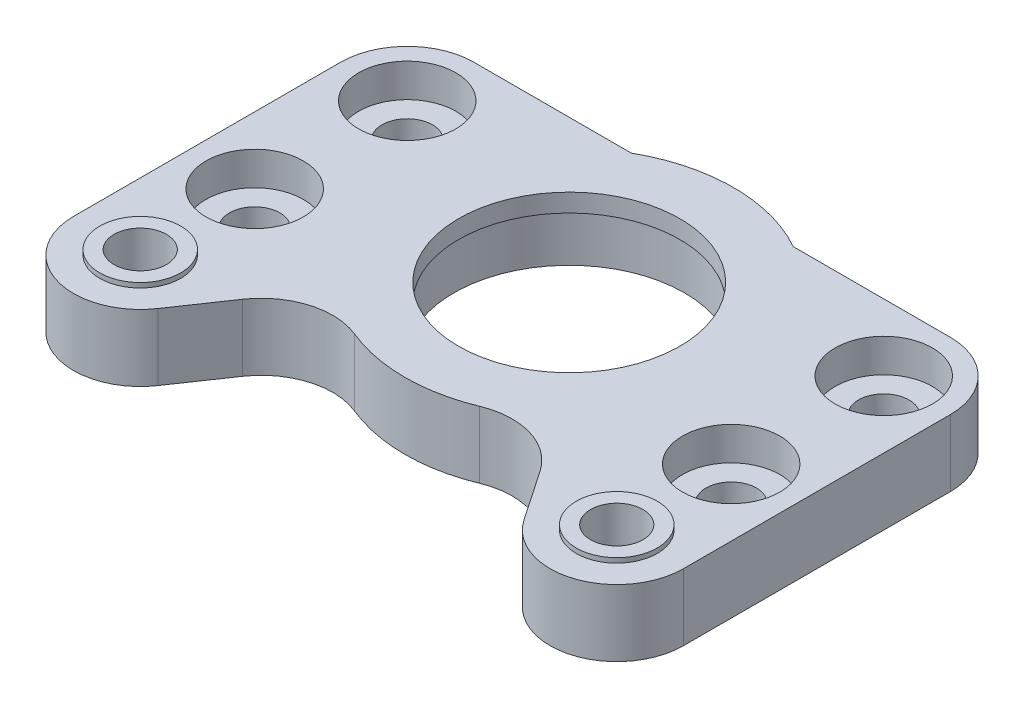
ISO-10303-21;
HEADER;
FILE_DESCRIPTION(('STEP AP214'),'2;1');
FILE_NAME('part.step','',(''),(''),'','','');
FILE_SCHEMA(('AUTOMOTIVE_DESIGN { 1 0 10303 214 1 1 1 1 }'));
ENDSEC;
DATA;
#1=APPLICATION_CONTEXT('core data for automotive mechanical design processes');
#2=APPLICATION_PROTOCOL_DEFINITION('international standard','automotive_design',2000,#1);
#3=PRODUCT_CONTEXT('',#1,'mechanical');
#4=PRODUCT('Part','Part','',(#3));
#5=PRODUCT_RELATED_PRODUCT_CATEGORY('part','',(#4));
#6=PRODUCT_DEFINITION_FORMATION('','',#4);
#7=PRODUCT_DEFINITION_CONTEXT('part definition',#1,'design');
#8=PRODUCT_DEFINITION('design','',#6,#7);
#9=PRODUCT_DEFINITION_SHAPE('','',#8);
#10=(LENGTH_UNIT() NAMED_UNIT(*) SI_UNIT(.MILLI.,.METRE.));
#11=(NAMED_UNIT(*) PLANE_ANGLE_UNIT() SI_UNIT($,.RADIAN.));
#12=(NAMED_UNIT(*) SI_UNIT($,.STERADIAN.) SOLID_ANGLE_UNIT());
#13=UNCERTAINTY_MEASURE_WITH_UNIT(LENGTH_MEASURE(1.E-05),#10,'distance_accuracy_value','');
#14=(GEOMETRIC_REPRESENTATION_CONTEXT(3) GLOBAL_UNCERTAINTY_ASSIGNED_CONTEXT((#13)) GLOBAL_UNIT_ASSIGNED_CONTEXT((#10,
#11,#12)) REPRESENTATION_CONTEXT('',''));
#15=CARTESIAN_POINT('',(0.,0.,0.));
#16=DIRECTION('',(0.,0.,1.));
#17=DIRECTION('',(1.,0.,0.));
#18=AXIS2_PLACEMENT_3D('',#15,#16,#17);
#19=CARTESIAN_POINT('',(0.,7.,0.));
#20=DIRECTION('',(0.,1.,0.));
#21=DIRECTION('',(0.,0.,1.));
#22=AXIS2_PLACEMENT_3D('',#19,#20,#21);
#23=PLANE('',#22);
#24=CARTESIAN_POINT('',(7.,7.,35.));
#25=DIRECTION('',(0.,1.,0.));
#26=DIRECTION('',(0.,0.,1.));
#27=AXIS2_PLACEMENT_3D('',#24,#25,#26);
#28=CIRCLE('',#27,4.25);
#29=CARTESIAN_POINT('',(7.,7.,39.25));
#30=VERTEX_POINT('',#29);
#31=EDGE_CURVE('E455',#30,#30,#28,.T.);
#32=ORIENTED_EDGE('',*,*,#31,.F.);
#33=EDGE_LOOP('',(#32));
#34=FACE_BOUND('',#33,.T.);
#35=CARTESIAN_POINT('',(56.9716403321052,7.,7.));
#36=DIRECTION('',(0.,1.,0.));
#37=DIRECTION('',(0.,0.,1.));
#38=AXIS2_PLACEMENT_3D('',#35,#36,#37);
#39=CIRCLE('',#38,5.1);
#40=CARTESIAN_POINT('',(56.9716403321052,7.,12.1));
#41=VERTEX_POINT('',#40);
#42=EDGE_CURVE('E481',#41,#41,#39,.T.);
#43=ORIENTED_EDGE('',*,*,#42,.F.);
#44=EDGE_LOOP('',(#43));
#45=FACE_BOUND('',#44,.T.);
#46=CARTESIAN_POINT('',(56.9716403321052,7.,23.));
#47=DIRECTION('',(0.,1.,0.));
#48=DIRECTION('',(0.,0.,1.));
#49=AXIS2_PLACEMENT_3D('',#46,#47,#48);
#50=CIRCLE('',#49,5.1);
#51=CARTESIAN_POINT('',(56.9716403321052,7.,28.1));
#52=VERTEX_POINT('',#51);
#53=EDGE_CURVE('E473',#52,#52,#50,.T.);
#54=ORIENTED_EDGE('',*,*,#53,.F.);
#55=EDGE_LOOP('',(#54));
#56=FACE_BOUND('',#55,.T.);
#57=CARTESIAN_POINT('',(7.,7.,7.));
#58=DIRECTION('',(0.,-1.,0.));
#59=DIRECTION('',(0.,0.,-1.));
#60=AXIS2_PLACEMENT_3D('',#57,#58,#59);
#61=CIRCLE('',#60,5.1);
#62=CARTESIAN_POINT('',(7.,7.,1.9));
#63=VERTEX_POINT('',#62);
#64=EDGE_CURVE('E491',#63,#63,#61,.T.);
#65=ORIENTED_EDGE('',*,*,#64,.T.);
#66=EDGE_LOOP('',(#65));
#67=FACE_BOUND('',#66,.T.);
#68=DIRECTION('',(1.,0.,0.));
#69=VECTOR('',#68,1.);
#70=CARTESIAN_POINT('',(0.,7.,0.));
#71=LINE('',#70,#69);
#72=CARTESIAN_POINT('',(40.4801502185656,7.,0.));
#73=VERTEX_POINT('',#72);
#74=CARTESIAN_POINT('',(56.9716403321052,7.,0.));
#75=VERTEX_POINT('',#74);
#76=EDGE_CURVE('E258',#73,#75,#71,.T.);
#77=ORIENTED_EDGE('',*,*,#76,.F.);
#78=CARTESIAN_POINT('',(31.9858201660526,7.,15.));
#79=DIRECTION('',(0.,1.,0.));
#80=DIRECTION('',(0.,0.,1.));
#81=AXIS2_PLACEMENT_3D('',#78,#79,#80);
#82=CIRCLE('',#81,17.238145);
#83=CARTESIAN_POINT('',(23.4914901135396,7.,0.));
#84=VERTEX_POINT('',#83);
#85=EDGE_CURVE('E324',#73,#84,#82,.T.);
#86=ORIENTED_EDGE('',*,*,#85,.T.);
#87=DIRECTION('',(1.,0.,0.));
#88=VECTOR('',#87,1.);
#89=CARTESIAN_POINT('',(0.,7.,0.));
#90=LINE('',#89,#88);
#91=CARTESIAN_POINT('',(7.,7.,0.));
#92=VERTEX_POINT('',#91);
#93=EDGE_CURVE('E327',#92,#84,#90,.T.);
#94=ORIENTED_EDGE('',*,*,#93,.F.);
#95=CARTESIAN_POINT('',(7.,7.,7.));
#96=DIRECTION('',(0.,1.,0.));
#97=DIRECTION('',(0.,0.,1.));
#98=AXIS2_PLACEMENT_3D('',#95,#96,#97);
#99=CIRCLE('',#98,7.);
#100=CARTESIAN_POINT('',(0.,7.,7.));
#101=VERTEX_POINT('',#100);
#102=EDGE_CURVE('E331',#92,#101,#99,.T.);
#103=ORIENTED_EDGE('',*,*,#102,.T.);
#104=DIRECTION('',(0.,0.,1.));
#105=VECTOR('',#104,1.);
#106=CARTESIAN_POINT('',(0.,7.,0.));
#107=LINE('',#106,#105);
#108=CARTESIAN_POINT('',(0.,7.,35.));
#109=VERTEX_POINT('',#108);
#110=EDGE_CURVE('E335',#101,#109,#107,.T.);
#111=ORIENTED_EDGE('',*,*,#110,.T.);
#112=CARTESIAN_POINT('',(7.,7.,35.));
#113=DIRECTION('',(0.,1.,0.));
#114=DIRECTION('',(0.,0.,1.));
#115=AXIS2_PLACEMENT_3D('',#112,#113,#114);
#116=CIRCLE('',#115,7.);
#117=CARTESIAN_POINT('',(12.7861282438903,7.,38.9396344938655));
#118=VERTEX_POINT('',#117);
#119=EDGE_CURVE('E339',#109,#118,#116,.T.);
#120=ORIENTED_EDGE('',*,*,#119,.T.);
#121=DIRECTION('',(-0.562804927695071,0.,0.826589749127187));
#122=VECTOR('',#121,1.);
#123=CARTESIAN_POINT('',(26.8511899771108,7.,18.2823245141275));
#124=LINE('',#123,#122);
#125=CARTESIAN_POINT('',(16.3812445535322,7.,33.6594989757913));
#126=VERTEX_POINT('',#125);
#127=EDGE_CURVE('E342',#126,#118,#124,.T.);
#128=ORIENTED_EDGE('',*,*,#127,.F.);
#129=CARTESIAN_POINT('',(22.5806676719861,7.,37.8805359335043));
#130=DIRECTION('',(0.,1.,0.));
#131=DIRECTION('',(0.,0.,1.));
#132=AXIS2_PLACEMENT_3D('',#129,#130,#131);
#133=CIRCLE('',#132,7.49999999999999);
#134=CARTESIAN_POINT('',(25.4320796798589,7.,30.9437175301324));
#135=VERTEX_POINT('',#134);
#136=EDGE_CURVE('E346',#126,#135,#133,.F.);
#137=ORIENTED_EDGE('',*,*,#136,.T.);
#138=CARTESIAN_POINT('',(31.9858201660526,7.,15.));
#139=DIRECTION('',(0.,1.,0.));
#140=DIRECTION('',(0.,0.,1.));
#141=AXIS2_PLACEMENT_3D('',#138,#139,#140);
#142=CIRCLE('',#141,17.238145);
#143=CARTESIAN_POINT('',(38.5395606522463,7.,30.9437175301324));
#144=VERTEX_POINT('',#143);
#145=EDGE_CURVE('E350',#135,#144,#142,.T.);
#146=ORIENTED_EDGE('',*,*,#145,.T.);
#147=CARTESIAN_POINT('',(41.3909726601191,7.,37.8805359335043));
#148=DIRECTION('',(0.,1.,0.));
#149=DIRECTION('',(0.,0.,1.));
#150=AXIS2_PLACEMENT_3D('',#147,#148,#149);
#151=CIRCLE('',#150,7.5);
#152=CARTESIAN_POINT('',(47.590395778573,7.,33.6594989757913));
#153=VERTEX_POINT('',#152);
#154=EDGE_CURVE('E353',#153,#144,#151,.T.);
#155=ORIENTED_EDGE('',*,*,#154,.F.);
#156=DIRECTION('',(0.56280492769507,0.,0.826589749127188));
#157=VECTOR('',#156,1.);
#158=CARTESIAN_POINT('',(16.8574725175827,7.,-11.4778444946817));
#159=LINE('',#158,#157);
#160=CARTESIAN_POINT('',(51.1855120882149,7.,38.9396344938655));
#161=VERTEX_POINT('',#160);
#162=EDGE_CURVE('E173',#153,#161,#159,.T.);
#163=ORIENTED_EDGE('',*,*,#162,.T.);
#164=CARTESIAN_POINT('',(56.9716403321052,7.,35.));
#165=DIRECTION('',(0.,1.,0.));
#166=DIRECTION('',(0.,0.,1.));
#167=AXIS2_PLACEMENT_3D('',#164,#165,#166);
#168=CIRCLE('',#167,7.00000000000001);
#169=CARTESIAN_POINT('',(63.9716403321052,7.,35.));
#170=VERTEX_POINT('',#169);
#171=EDGE_CURVE('E156',#170,#161,#168,.F.);
#172=ORIENTED_EDGE('',*,*,#171,.F.);
#173=DIRECTION('',(0.,0.,1.));
#174=VECTOR('',#173,1.);
#175=CARTESIAN_POINT('',(63.9716403321052,7.,0.));
#176=LINE('',#175,#174);
#177=CARTESIAN_POINT('',(63.9716403321052,7.,7.00000000000001));
#178=VERTEX_POINT('',#177);
#179=EDGE_CURVE('E170',#178,#170,#176,.T.);
#180=ORIENTED_EDGE('',*,*,#179,.F.);
#181=CARTESIAN_POINT('',(56.9716403321052,7.,7.));
#182=DIRECTION('',(0.,1.,0.));
#183=DIRECTION('',(0.,0.,1.));
#184=AXIS2_PLACEMENT_3D('',#181,#182,#183);
#185=CIRCLE('',#184,7.);
#186=EDGE_CURVE('E179',#75,#178,#185,.F.);
#187=ORIENTED_EDGE('',*,*,#186,.F.);
#188=EDGE_LOOP('',(#77,#86,#94,#103,#111,#120,#128,#137,#146,#155,#163,#172,#180,#187));
#189=FACE_BOUND('',#188,.T.);
#190=CARTESIAN_POINT('',(31.9858201660526,7.,15.));
#191=DIRECTION('',(0.,1.,0.));
#192=DIRECTION('',(0.,0.,1.));
#193=AXIS2_PLACEMENT_3D('',#190,#191,#192);
#194=CIRCLE('',#193,11.6);
#195=CARTESIAN_POINT('',(31.9858201660526,7.,26.6));
#196=VERTEX_POINT('',#195);
#197=EDGE_CURVE('E305',#196,#196,#194,.T.);
#198=ORIENTED_EDGE('',*,*,#197,.F.);
#199=EDGE_LOOP('',(#198));
#200=FACE_BOUND('',#199,.T.);
#201=CARTESIAN_POINT('',(7.,7.,23.));
#202=DIRECTION('',(0.,-1.,0.));
#203=DIRECTION('',(0.,0.,-1.));
#204=AXIS2_PLACEMENT_3D('',#201,#202,#203);
#205=CIRCLE('',#204,5.1);
#206=CARTESIAN_POINT('',(7.,7.,17.9));
#207=VERTEX_POINT('',#206);
#208=EDGE_CURVE('E464',#207,#207,#205,.T.);
#209=ORIENTED_EDGE('',*,*,#208,.T.);
#210=EDGE_LOOP('',(#209));
#211=FACE_BOUND('',#210,.T.);
#212=CARTESIAN_POINT('',(56.9716403321052,7.,35.));
#213=DIRECTION('',(0.,1.,0.));
#214=DIRECTION('',(0.,0.,1.));
#215=AXIS2_PLACEMENT_3D('',#212,#213,#214);
#216=CIRCLE('',#215,4.25000000000001);
#217=CARTESIAN_POINT('',(56.9716403321052,7.,39.25));
#218=VERTEX_POINT('',#217);
#219=EDGE_CURVE('E435',#218,#218,#216,.T.);
#220=ORIENTED_EDGE('',*,*,#219,.F.);
#221=EDGE_LOOP('',(#220));
#222=FACE_BOUND('',#221,.T.);
#223=ADVANCED_FACE('F47',(#34,#45,#56,#67,#189,#200,#211,#222),#23,.T.);
#224=CARTESIAN_POINT('',(56.9716403321052,7.,23.));
#225=DIRECTION('',(0.,-1.,0.));
#226=DIRECTION('',(0.,0.,-1.));
#227=AXIS2_PLACEMENT_3D('',#224,#225,#226);
#228=CYLINDRICAL_SURFACE('',#227,2.65);
#229=CARTESIAN_POINT('',(56.9716403321052,0.,23.));
#230=DIRECTION('',(0.,1.,0.));
#231=DIRECTION('',(0.,0.,1.));
#232=AXIS2_PLACEMENT_3D('',#229,#230,#231);
#233=CIRCLE('',#232,2.65);
#234=CARTESIAN_POINT('',(56.9716403321052,0.,25.65));
#235=VERTEX_POINT('',#234);
#236=EDGE_CURVE('E198',#235,#235,#233,.F.);
#237=ORIENTED_EDGE('',*,*,#236,.T.);
#238=EDGE_LOOP('',(#237));
#239=FACE_BOUND('',#238,.T.);
#240=CARTESIAN_POINT('',(56.9716403321052,3.5,23.));
#241=DIRECTION('',(0.,1.,0.));
#242=DIRECTION('',(0.,0.,1.));
#243=AXIS2_PLACEMENT_3D('',#240,#241,#242);
#244=CIRCLE('',#243,2.65);
#245=CARTESIAN_POINT('',(56.9716403321052,3.5,25.65));
#246=VERTEX_POINT('',#245);
#247=EDGE_CURVE('E51',#246,#246,#244,.F.);
#248=ORIENTED_EDGE('',*,*,#247,.F.);
#249=EDGE_LOOP('',(#248));
#250=FACE_BOUND('',#249,.T.);
#251=ADVANCED_FACE('F381',(#239,#250),#228,.F.);
#252=CARTESIAN_POINT('',(56.9716403321052,7.,7.));
#253=DIRECTION('',(0.,-1.,0.));
#254=DIRECTION('',(0.,0.,-1.));
#255=AXIS2_PLACEMENT_3D('',#252,#253,#254);
#256=CYLINDRICAL_SURFACE('',#255,2.65);
#257=CARTESIAN_POINT('',(56.9716403321052,0.,7.));
#258=DIRECTION('',(0.,1.,0.));
#259=DIRECTION('',(0.,0.,1.));
#260=AXIS2_PLACEMENT_3D('',#257,#258,#259);
#261=CIRCLE('',#260,2.65);
#262=CARTESIAN_POINT('',(56.9716403321052,0.,9.65));
#263=VERTEX_POINT('',#262);
#264=EDGE_CURVE('E185',#263,#263,#261,.F.);
#265=ORIENTED_EDGE('',*,*,#264,.T.);
#266=EDGE_LOOP('',(#265));
#267=FACE_BOUND('',#266,.T.);
#268=CARTESIAN_POINT('',(56.9716403321052,3.5,7.));
#269=DIRECTION('',(0.,1.,0.));
#270=DIRECTION('',(0.,0.,1.));
#271=AXIS2_PLACEMENT_3D('',#268,#269,#270);
#272=CIRCLE('',#271,2.65);
#273=CARTESIAN_POINT('',(56.9716403321052,3.5,9.65));
#274=VERTEX_POINT('',#273);
#275=EDGE_CURVE('E294',#274,#274,#272,.F.);
#276=ORIENTED_EDGE('',*,*,#275,.F.);
#277=EDGE_LOOP('',(#276));
#278=FACE_BOUND('',#277,.T.);
#279=ADVANCED_FACE('F49',(#267,#278),#256,.F.);
#280=CARTESIAN_POINT('',(31.9858201660526,7.,15.));
#281=DIRECTION('',(0.,-1.,0.));
#282=DIRECTION('',(0.,0.,-1.));
#283=AXIS2_PLACEMENT_3D('',#280,#281,#282);
#284=CYLINDRICAL_SURFACE('',#283,12.1);
#285=CARTESIAN_POINT('',(31.9858201660526,0.,15.));
#286=DIRECTION('',(0.,1.,0.));
#287=DIRECTION('',(0.,0.,1.));
#288=AXIS2_PLACEMENT_3D('',#285,#286,#287);
#289=CIRCLE('',#288,12.1);
#290=CARTESIAN_POINT('',(31.9858201660526,0.,27.1));
#291=VERTEX_POINT('',#290);
#292=EDGE_CURVE('E202',#291,#291,#289,.T.);
#293=ORIENTED_EDGE('',*,*,#292,.F.);
#294=EDGE_LOOP('',(#293));
#295=FACE_BOUND('',#294,.T.);
#296=CARTESIAN_POINT('',(31.9858201660526,5.1,15.));
#297=DIRECTION('',(0.,1.,0.));
#298=DIRECTION('',(0.,0.,1.));
#299=AXIS2_PLACEMENT_3D('',#296,#297,#298);
#300=CIRCLE('',#299,12.1);
#301=CARTESIAN_POINT('',(31.9858201660526,5.1,27.1));
#302=VERTEX_POINT('',#301);
#303=EDGE_CURVE('E190',#302,#302,#300,.T.);
#304=ORIENTED_EDGE('',*,*,#303,.T.);
#305=EDGE_LOOP('',(#304));
#306=FACE_BOUND('',#305,.T.);
#307=ADVANCED_FACE('F526',(#295,#306),#284,.F.);
#308=CARTESIAN_POINT('',(0.,7.,0.));
#309=DIRECTION('',(0.,0.,-1.));
#310=DIRECTION('',(-1.,0.,0.));
#311=AXIS2_PLACEMENT_3D('',#308,#309,#310);
#312=PLANE('',#311);
#313=DIRECTION('',(1.,0.,0.));
#314=VECTOR('',#313,1.);
#315=CARTESIAN_POINT('',(0.,0.,0.));
#316=LINE('',#315,#314);
#317=CARTESIAN_POINT('',(40.4801502185656,0.,0.));
#318=VERTEX_POINT('',#317);
#319=CARTESIAN_POINT('',(56.9716403321052,0.,0.));
#320=VERTEX_POINT('',#319);
#321=EDGE_CURVE('E206',#318,#320,#316,.T.);
#322=ORIENTED_EDGE('',*,*,#321,.F.);
#323=DIRECTION('',(0.,-1.,0.));
#324=VECTOR('',#323,1.);
#325=CARTESIAN_POINT('',(40.4801502185656,7.,0.));
#326=LINE('',#325,#324);
#327=EDGE_CURVE('E12',#73,#318,#326,.T.);
#328=ORIENTED_EDGE('',*,*,#327,.F.);
#329=ORIENTED_EDGE('',*,*,#76,.T.);
#330=DIRECTION('',(0.,-1.,0.));
#331=VECTOR('',#330,1.);
#332=CARTESIAN_POINT('',(56.9716403321052,7.,0.));
#333=LINE('',#332,#331);
#334=EDGE_CURVE('E67',#75,#320,#333,.T.);
#335=ORIENTED_EDGE('',*,*,#334,.T.);
#336=EDGE_LOOP('',(#322,#328,#329,#335));
#337=FACE_BOUND('',#336,.T.);
#338=ADVANCED_FACE('F528',(#337),#312,.T.);
#339=CARTESIAN_POINT('',(31.9858201660526,7.,15.));
#340=DIRECTION('',(0.,-1.,0.));
#341=DIRECTION('',(0.,0.,-1.));
#342=AXIS2_PLACEMENT_3D('',#339,#340,#341);
#343=CYLINDRICAL_SURFACE('',#342,17.238145);
#344=CARTESIAN_POINT('',(31.9858201660526,0.,15.));
#345=DIRECTION('',(0.,1.,0.));
#346=DIRECTION('',(0.,0.,1.));
#347=AXIS2_PLACEMENT_3D('',#344,#345,#346);
#348=CIRCLE('',#347,17.238145);
#349=CARTESIAN_POINT('',(23.4914901135396,0.,0.));
#350=VERTEX_POINT('',#349);
#351=EDGE_CURVE('E209',#318,#350,#348,.T.);
#352=ORIENTED_EDGE('',*,*,#351,.T.);
#353=DIRECTION('',(0.,-1.,0.));
#354=VECTOR('',#353,1.);
#355=CARTESIAN_POINT('',(23.4914901135396,7.,0.));
#356=LINE('',#355,#354);
#357=EDGE_CURVE('E58',#84,#350,#356,.T.);
#358=ORIENTED_EDGE('',*,*,#357,.F.);
#359=ORIENTED_EDGE('',*,*,#85,.F.);
#360=ORIENTED_EDGE('',*,*,#327,.T.);
#361=EDGE_LOOP('',(#352,#358,#359,#360));
#362=FACE_BOUND('',#361,.T.);
#363=ADVANCED_FACE('F534',(#362),#343,.T.);
#364=CARTESIAN_POINT('',(0.,7.,0.));
#365=DIRECTION('',(0.,0.,-1.));
#366=DIRECTION('',(-1.,0.,0.));
#367=AXIS2_PLACEMENT_3D('',#364,#365,#366);
#368=PLANE('',#367);
#369=DIRECTION('',(1.,0.,0.));
#370=VECTOR('',#369,1.);
#371=CARTESIAN_POINT('',(0.,0.,0.));
#372=LINE('',#371,#370);
#373=CARTESIAN_POINT('',(7.,0.,0.));
#374=VERTEX_POINT('',#373);
#375=EDGE_CURVE('E213',#374,#350,#372,.T.);
#376=ORIENTED_EDGE('',*,*,#375,.F.);
#377=DIRECTION('',(0.,-1.,0.));
#378=VECTOR('',#377,1.);
#379=CARTESIAN_POINT('',(7.,7.,0.));
#380=LINE('',#379,#378);
#381=EDGE_CURVE('E289',#92,#374,#380,.T.);
#382=ORIENTED_EDGE('',*,*,#381,.F.);
#383=ORIENTED_EDGE('',*,*,#93,.T.);
#384=ORIENTED_EDGE('',*,*,#357,.T.);
#385=EDGE_LOOP('',(#376,#382,#383,#384));
#386=FACE_BOUND('',#385,.T.);
#387=ADVANCED_FACE('F541',(#386),#368,.T.);
#388=CARTESIAN_POINT('',(7.,7.,7.));
#389=DIRECTION('',(0.,-1.,0.));
#390=DIRECTION('',(0.,0.,-1.));
#391=AXIS2_PLACEMENT_3D('',#388,#389,#390);
#392=CYLINDRICAL_SURFACE('',#391,7.);
#393=CARTESIAN_POINT('',(7.,0.,7.));
#394=DIRECTION('',(0.,1.,0.));
#395=DIRECTION('',(0.,0.,1.));
#396=AXIS2_PLACEMENT_3D('',#393,#394,#395);
#397=CIRCLE('',#396,7.);
#398=CARTESIAN_POINT('',(0.,0.,7.));
#399=VERTEX_POINT('',#398);
#400=EDGE_CURVE('E217',#374,#399,#397,.T.);
#401=ORIENTED_EDGE('',*,*,#400,.T.);
#402=DIRECTION('',(0.,-1.,0.));
#403=VECTOR('',#402,1.);
#404=CARTESIAN_POINT('',(0.,7.,7.));
#405=LINE('',#404,#403);
#406=EDGE_CURVE('E285',#101,#399,#405,.T.);
#407=ORIENTED_EDGE('',*,*,#406,.F.);
#408=ORIENTED_EDGE('',*,*,#102,.F.);
#409=ORIENTED_EDGE('',*,*,#381,.T.);
#410=EDGE_LOOP('',(#401,#407,#408,#409));
#411=FACE_BOUND('',#410,.T.);
#412=ADVANCED_FACE('F545',(#411),#392,.T.);
#413=CARTESIAN_POINT('',(0.,7.,0.));
#414=DIRECTION('',(1.,0.,0.));
#415=DIRECTION('',(0.,0.,-1.));
#416=AXIS2_PLACEMENT_3D('',#413,#414,#415);
#417=PLANE('',#416);
#418=DIRECTION('',(0.,0.,1.));
#419=VECTOR('',#418,1.);
#420=CARTESIAN_POINT('',(0.,0.,0.));
#421=LINE('',#420,#419);
#422=CARTESIAN_POINT('',(0.,0.,35.));
#423=VERTEX_POINT('',#422);
#424=EDGE_CURVE('E221',#399,#423,#421,.T.);
#425=ORIENTED_EDGE('',*,*,#424,.T.);
#426=DIRECTION('',(0.,-1.,0.));
#427=VECTOR('',#426,1.);
#428=CARTESIAN_POINT('',(0.,7.,35.));
#429=LINE('',#428,#427);
#430=EDGE_CURVE('E281',#109,#423,#429,.T.);
#431=ORIENTED_EDGE('',*,*,#430,.F.);
#432=ORIENTED_EDGE('',*,*,#110,.F.);
#433=ORIENTED_EDGE('',*,*,#406,.T.);
#434=EDGE_LOOP('',(#425,#431,#432,#433));
#435=FACE_BOUND('',#434,.T.);
#436=ADVANCED_FACE('F549',(#435),#417,.F.);
#437=CARTESIAN_POINT('',(7.,7.,35.));
#438=DIRECTION('',(0.,-1.,0.));
#439=DIRECTION('',(0.,0.,-1.));
#440=AXIS2_PLACEMENT_3D('',#437,#438,#439);
#441=CYLINDRICAL_SURFACE('',#440,7.);
#442=CARTESIAN_POINT('',(7.,0.,35.));
#443=DIRECTION('',(0.,1.,0.));
#444=DIRECTION('',(0.,0.,1.));
#445=AXIS2_PLACEMENT_3D('',#442,#443,#444);
#446=CIRCLE('',#445,7.);
#447=CARTESIAN_POINT('',(12.7861282438903,0.,38.9396344938655));
#448=VERTEX_POINT('',#447);
#449=EDGE_CURVE('E225',#423,#448,#446,.T.);
#450=ORIENTED_EDGE('',*,*,#449,.T.);
#451=DIRECTION('',(0.,-1.,0.));
#452=VECTOR('',#451,1.);
#453=CARTESIAN_POINT('',(12.7861282438903,7.,38.9396344938655));
#454=LINE('',#453,#452);
#455=EDGE_CURVE('E278',#118,#448,#454,.T.);
#456=ORIENTED_EDGE('',*,*,#455,.F.);
#457=ORIENTED_EDGE('',*,*,#119,.F.);
#458=ORIENTED_EDGE('',*,*,#430,.T.);
#459=EDGE_LOOP('',(#450,#456,#457,#458));
#460=FACE_BOUND('',#459,.T.);
#461=ADVANCED_FACE('F553',(#460),#441,.T.);
#462=CARTESIAN_POINT('',(26.8511899771108,7.,18.2823245141275));
#463=DIRECTION('',(0.826589749127187,0.,0.562804927695071));
#464=DIRECTION('',(0.562804927695071,0.,-0.826589749127187));
#465=AXIS2_PLACEMENT_3D('',#462,#463,#464);
#466=PLANE('',#465);
#467=DIRECTION('',(-0.562804927695071,0.,0.826589749127187));
#468=VECTOR('',#467,1.);
#469=CARTESIAN_POINT('',(26.8511899771108,0.,18.2823245141275));
#470=LINE('',#469,#468);
#471=CARTESIAN_POINT('',(16.3812445535322,0.,33.6594989757913));
#472=VERTEX_POINT('',#471);
#473=EDGE_CURVE('E229',#472,#448,#470,.T.);
#474=ORIENTED_EDGE('',*,*,#473,.F.);
#475=DIRECTION('',(0.,-1.,0.));
#476=VECTOR('',#475,1.);
#477=CARTESIAN_POINT('',(16.3812445535322,7.,33.6594989757913));
#478=LINE('',#477,#476);
#479=EDGE_CURVE('E275',#126,#472,#478,.T.);
#480=ORIENTED_EDGE('',*,*,#479,.F.);
#481=ORIENTED_EDGE('',*,*,#127,.T.);
#482=ORIENTED_EDGE('',*,*,#455,.T.);
#483=EDGE_LOOP('',(#474,#480,#481,#482));
#484=FACE_BOUND('',#483,.T.);
#485=ADVANCED_FACE('F557',(#484),#466,.T.);
#486=CARTESIAN_POINT('',(22.5806676719861,7.,37.8805359335043));
#487=DIRECTION('',(0.,-1.,0.));
#488=DIRECTION('',(0.,0.,-1.));
#489=AXIS2_PLACEMENT_3D('',#486,#487,#488);
#490=CYLINDRICAL_SURFACE('',#489,7.49999999999999);
#491=CARTESIAN_POINT('',(22.5806676719861,0.,37.8805359335043));
#492=DIRECTION('',(0.,1.,0.));
#493=DIRECTION('',(0.,0.,1.));
#494=AXIS2_PLACEMENT_3D('',#491,#492,#493);
#495=CIRCLE('',#494,7.49999999999999);
#496=CARTESIAN_POINT('',(25.4320796798589,0.,30.9437175301324));
#497=VERTEX_POINT('',#496);
#498=EDGE_CURVE('E233',#472,#497,#495,.F.);
#499=ORIENTED_EDGE('',*,*,#498,.T.);
#500=DIRECTION('',(0.,-1.,0.));
#501=VECTOR('',#500,1.);
#502=CARTESIAN_POINT('',(25.4320796798589,7.,30.9437175301324));
#503=LINE('',#502,#501);
#504=EDGE_CURVE('E271',#135,#497,#503,.T.);
#505=ORIENTED_EDGE('',*,*,#504,.F.);
#506=ORIENTED_EDGE('',*,*,#136,.F.);
#507=ORIENTED_EDGE('',*,*,#479,.T.);
#508=EDGE_LOOP('',(#499,#505,#506,#507));
#509=FACE_BOUND('',#508,.T.);
#510=ADVANCED_FACE('F561',(#509),#490,.F.);
#511=CARTESIAN_POINT('',(31.9858201660526,7.,15.));
#512=DIRECTION('',(0.,-1.,0.));
#513=DIRECTION('',(0.,0.,-1.));
#514=AXIS2_PLACEMENT_3D('',#511,#512,#513);
#515=CYLINDRICAL_SURFACE('',#514,17.238145);
#516=CARTESIAN_POINT('',(31.9858201660526,0.,15.));
#517=DIRECTION('',(0.,1.,0.));
#518=DIRECTION('',(0.,0.,1.));
#519=AXIS2_PLACEMENT_3D('',#516,#517,#518);
#520=CIRCLE('',#519,17.238145);
#521=CARTESIAN_POINT('',(38.5395606522463,0.,30.9437175301324));
#522=VERTEX_POINT('',#521);
#523=EDGE_CURVE('E237',#497,#522,#520,.T.);
#524=ORIENTED_EDGE('',*,*,#523,.T.);
#525=DIRECTION('',(0.,-1.,0.));
#526=VECTOR('',#525,1.);
#527=CARTESIAN_POINT('',(38.5395606522463,7.,30.9437175301324));
#528=LINE('',#527,#526);
#529=EDGE_CURVE('E268',#144,#522,#528,.T.);
#530=ORIENTED_EDGE('',*,*,#529,.F.);
#531=ORIENTED_EDGE('',*,*,#145,.F.);
#532=ORIENTED_EDGE('',*,*,#504,.T.);
#533=EDGE_LOOP('',(#524,#530,#531,#532));
#534=FACE_BOUND('',#533,.T.);
#535=ADVANCED_FACE('F365',(#534),#515,.T.);
#536=CARTESIAN_POINT('',(41.3909726601191,7.,37.8805359335043));
#537=DIRECTION('',(0.,-1.,0.));
#538=DIRECTION('',(0.,0.,-1.));
#539=AXIS2_PLACEMENT_3D('',#536,#537,#538);
#540=CYLINDRICAL_SURFACE('',#539,7.5);
#541=CARTESIAN_POINT('',(41.3909726601191,0.,37.8805359335043));
#542=DIRECTION('',(0.,1.,0.));
#543=DIRECTION('',(0.,0.,1.));
#544=AXIS2_PLACEMENT_3D('',#541,#542,#543);
#545=CIRCLE('',#544,7.5);
#546=CARTESIAN_POINT('',(47.590395778573,0.,33.6594989757913));
#547=VERTEX_POINT('',#546);
#548=EDGE_CURVE('E241',#547,#522,#545,.T.);
#549=ORIENTED_EDGE('',*,*,#548,.F.);
#550=DIRECTION('',(0.,-1.,0.));
#551=VECTOR('',#550,1.);
#552=CARTESIAN_POINT('',(47.590395778573,7.,33.6594989757913));
#553=LINE('',#552,#551);
#554=EDGE_CURVE('E265',#153,#547,#553,.T.);
#555=ORIENTED_EDGE('',*,*,#554,.F.);
#556=ORIENTED_EDGE('',*,*,#154,.T.);
#557=ORIENTED_EDGE('',*,*,#529,.T.);
#558=EDGE_LOOP('',(#549,#555,#556,#557));
#559=FACE_BOUND('',#558,.T.);
#560=ADVANCED_FACE('F359',(#559),#540,.F.);
#561=CARTESIAN_POINT('',(16.8574725175827,7.,-11.4778444946817));
#562=DIRECTION('',(0.826589749127188,0.,-0.56280492769507));
#563=DIRECTION('',(-0.56280492769507,0.,-0.826589749127188));
#564=AXIS2_PLACEMENT_3D('',#561,#562,#563);
#565=PLANE('',#564);
#566=DIRECTION('',(0.56280492769507,0.,0.826589749127188));
#567=VECTOR('',#566,1.);
#568=CARTESIAN_POINT('',(16.8574725175827,0.,-11.4778444946817));
#569=LINE('',#568,#567);
#570=CARTESIAN_POINT('',(51.1855120882149,0.,38.9396344938655));
#571=VERTEX_POINT('',#570);
#572=EDGE_CURVE('E245',#547,#571,#569,.T.);
#573=ORIENTED_EDGE('',*,*,#572,.T.);
#574=DIRECTION('',(0.,-1.,0.));
#575=VECTOR('',#574,1.);
#576=CARTESIAN_POINT('',(51.1855120882149,7.,38.9396344938655));
#577=LINE('',#576,#575);
#578=EDGE_CURVE('E163',#161,#571,#577,.T.);
#579=ORIENTED_EDGE('',*,*,#578,.F.);
#580=ORIENTED_EDGE('',*,*,#162,.F.);
#581=ORIENTED_EDGE('',*,*,#554,.T.);
#582=EDGE_LOOP('',(#573,#579,#580,#581));
#583=FACE_BOUND('',#582,.T.);
#584=ADVANCED_FACE('F371',(#583),#565,.F.);
#585=CARTESIAN_POINT('',(56.9716403321052,7.,35.));
#586=DIRECTION('',(0.,-1.,0.));
#587=DIRECTION('',(0.,0.,-1.));
#588=AXIS2_PLACEMENT_3D('',#585,#586,#587);
#589=CYLINDRICAL_SURFACE('',#588,7.00000000000001);
#590=CARTESIAN_POINT('',(56.9716403321052,0.,35.));
#591=DIRECTION('',(0.,1.,0.));
#592=DIRECTION('',(0.,0.,1.));
#593=AXIS2_PLACEMENT_3D('',#590,#591,#592);
#594=CIRCLE('',#593,7.00000000000001);
#595=CARTESIAN_POINT('',(63.9716403321052,0.,35.));
#596=VERTEX_POINT('',#595);
#597=EDGE_CURVE('E158',#596,#571,#594,.F.);
#598=ORIENTED_EDGE('',*,*,#597,.F.);
#599=DIRECTION('',(0.,-1.,0.));
#600=VECTOR('',#599,1.);
#601=CARTESIAN_POINT('',(63.9716403321052,7.,35.));
#602=LINE('',#601,#600);
#603=EDGE_CURVE('E153',#170,#596,#602,.T.);
#604=ORIENTED_EDGE('',*,*,#603,.F.);
#605=ORIENTED_EDGE('',*,*,#171,.T.);
#606=ORIENTED_EDGE('',*,*,#578,.T.);
#607=EDGE_LOOP('',(#598,#604,#605,#606));
#608=FACE_BOUND('',#607,.T.);
#609=ADVANCED_FACE('F155',(#608),#589,.T.);
#610=CARTESIAN_POINT('',(63.9716403321052,7.,0.));
#611=DIRECTION('',(1.,0.,0.));
#612=DIRECTION('',(0.,0.,-1.));
#613=AXIS2_PLACEMENT_3D('',#610,#611,#612);
#614=PLANE('',#613);
#615=DIRECTION('',(0.,0.,1.));
#616=VECTOR('',#615,1.);
#617=CARTESIAN_POINT('',(63.9716403321052,0.,0.));
#618=LINE('',#617,#616);
#619=CARTESIAN_POINT('',(63.9716403321052,0.,7.00000000000001));
#620=VERTEX_POINT('',#619);
#621=EDGE_CURVE('E251',#620,#596,#618,.T.);
#622=ORIENTED_EDGE('',*,*,#621,.F.);
#623=DIRECTION('',(0.,-1.,0.));
#624=VECTOR('',#623,1.);
#625=CARTESIAN_POINT('',(63.9716403321052,7.,7.00000000000001));
#626=LINE('',#625,#624);
#627=EDGE_CURVE('E110',#178,#620,#626,.T.);
#628=ORIENTED_EDGE('',*,*,#627,.F.);
#629=ORIENTED_EDGE('',*,*,#179,.T.);
#630=ORIENTED_EDGE('',*,*,#603,.T.);
#631=EDGE_LOOP('',(#622,#628,#629,#630));
#632=FACE_BOUND('',#631,.T.);
#633=ADVANCED_FACE('F177',(#632),#614,.T.);
#634=CARTESIAN_POINT('',(7.,7.,35.));
#635=DIRECTION('',(0.,-1.,0.));
#636=DIRECTION('',(0.,0.,-1.));
#637=AXIS2_PLACEMENT_3D('',#634,#635,#636);
#638=CYLINDRICAL_SURFACE('',#637,2.75);
#639=CARTESIAN_POINT('',(7.,3.35106382978723,35.));
#640=DIRECTION('',(0.,-1.,0.));
#641=DIRECTION('',(0.,0.,-1.));
#642=AXIS2_PLACEMENT_3D('',#639,#640,#641);
#643=CIRCLE('',#642,2.75);
#644=CARTESIAN_POINT('',(7.,3.35106382978723,32.25));
#645=VERTEX_POINT('',#644);
#646=EDGE_CURVE('E436',#645,#645,#643,.F.);
#647=ORIENTED_EDGE('',*,*,#646,.F.);
#648=EDGE_LOOP('',(#647));
#649=FACE_BOUND('',#648,.T.);
#650=CARTESIAN_POINT('',(7.,7.5,35.));
#651=DIRECTION('',(0.,1.,0.));
#652=DIRECTION('',(0.,0.,1.));
#653=AXIS2_PLACEMENT_3D('',#650,#651,#652);
#654=CIRCLE('',#653,2.75);
#655=CARTESIAN_POINT('',(7.,7.5,37.75));
#656=VERTEX_POINT('',#655);
#657=EDGE_CURVE('E450',#656,#656,#654,.T.);
#658=ORIENTED_EDGE('',*,*,#657,.T.);
#659=EDGE_LOOP('',(#658));
#660=FACE_BOUND('',#659,.T.);
#661=ADVANCED_FACE('F403',(#649,#660),#638,.F.);
#662=CARTESIAN_POINT('',(7.,7.,7.));
#663=DIRECTION('',(0.,-1.,0.));
#664=DIRECTION('',(0.,0.,-1.));
#665=AXIS2_PLACEMENT_3D('',#662,#663,#664);
#666=CYLINDRICAL_SURFACE('',#665,2.65);
#667=CARTESIAN_POINT('',(7.,3.5,7.));
#668=DIRECTION('',(0.,-1.,0.));
#669=DIRECTION('',(0.,0.,-1.));
#670=AXIS2_PLACEMENT_3D('',#667,#668,#669);
#671=CIRCLE('',#670,2.65);
#672=CARTESIAN_POINT('',(7.,3.5,4.35));
#673=VERTEX_POINT('',#672);
#674=EDGE_CURVE('E468',#673,#673,#671,.T.);
#675=ORIENTED_EDGE('',*,*,#674,.F.);
#676=EDGE_LOOP('',(#675));
#677=FACE_BOUND('',#676,.T.);
#678=CARTESIAN_POINT('',(7.,0.,7.));
#679=DIRECTION('',(0.,1.,0.));
#680=DIRECTION('',(0.,0.,1.));
#681=AXIS2_PLACEMENT_3D('',#678,#679,#680);
#682=CIRCLE('',#681,2.65);
#683=CARTESIAN_POINT('',(7.,0.,9.65));
#684=VERTEX_POINT('',#683);
#685=EDGE_CURVE('E194',#684,#684,#682,.T.);
#686=ORIENTED_EDGE('',*,*,#685,.F.);
#687=EDGE_LOOP('',(#686));
#688=FACE_BOUND('',#687,.T.);
#689=ADVANCED_FACE('F407',(#677,#688),#666,.F.);
#690=CARTESIAN_POINT('',(7.,7.,23.));
#691=DIRECTION('',(0.,-1.,0.));
#692=DIRECTION('',(0.,0.,-1.));
#693=AXIS2_PLACEMENT_3D('',#690,#691,#692);
#694=CYLINDRICAL_SURFACE('',#693,2.65);
#695=CARTESIAN_POINT('',(7.,3.5,23.));
#696=DIRECTION('',(0.,-1.,0.));
#697=DIRECTION('',(0.,0.,-1.));
#698=AXIS2_PLACEMENT_3D('',#695,#696,#697);
#699=CIRCLE('',#698,2.65);
#700=CARTESIAN_POINT('',(7.,3.5,20.35));
#701=VERTEX_POINT('',#700);
#702=EDGE_CURVE('E297',#701,#701,#699,.T.);
#703=ORIENTED_EDGE('',*,*,#702,.F.);
#704=EDGE_LOOP('',(#703));
#705=FACE_BOUND('',#704,.T.);
#706=CARTESIAN_POINT('',(7.,0.,23.));
#707=DIRECTION('',(0.,1.,0.));
#708=DIRECTION('',(0.,0.,1.));
#709=AXIS2_PLACEMENT_3D('',#706,#707,#708);
#710=CIRCLE('',#709,2.65);
#711=CARTESIAN_POINT('',(7.,0.,25.65));
#712=VERTEX_POINT('',#711);
#713=EDGE_CURVE('E189',#712,#712,#710,.T.);
#714=ORIENTED_EDGE('',*,*,#713,.F.);
#715=EDGE_LOOP('',(#714));
#716=FACE_BOUND('',#715,.T.);
#717=ADVANCED_FACE('F413',(#705,#716),#694,.F.);
#718=CARTESIAN_POINT('',(56.9716403321052,7.,35.));
#719=DIRECTION('',(0.,-1.,0.));
#720=DIRECTION('',(0.,0.,-1.));
#721=AXIS2_PLACEMENT_3D('',#718,#719,#720);
#722=CYLINDRICAL_SURFACE('',#721,2.74999999999999);
#723=CARTESIAN_POINT('',(56.9716403321052,3.35106382978724,35.));
#724=DIRECTION('',(0.,-1.,0.));
#725=DIRECTION('',(0.,0.,-1.));
#726=AXIS2_PLACEMENT_3D('',#723,#724,#725);
#727=CIRCLE('',#726,2.74999999999999);
#728=CARTESIAN_POINT('',(56.9716403321052,3.35106382978724,32.25));
#729=VERTEX_POINT('',#728);
#730=EDGE_CURVE('E429',#729,#729,#727,.T.);
#731=ORIENTED_EDGE('',*,*,#730,.T.);
#732=EDGE_LOOP('',(#731));
#733=FACE_BOUND('',#732,.T.);
#734=CARTESIAN_POINT('',(56.9716403321052,7.5,35.));
#735=DIRECTION('',(0.,1.,0.));
#736=DIRECTION('',(0.,0.,1.));
#737=AXIS2_PLACEMENT_3D('',#734,#735,#736);
#738=CIRCLE('',#737,2.74999999999999);
#739=CARTESIAN_POINT('',(56.9716403321052,7.5,37.75));
#740=VERTEX_POINT('',#739);
#741=EDGE_CURVE('E432',#740,#740,#738,.T.);
#742=ORIENTED_EDGE('',*,*,#741,.T.);
#743=EDGE_LOOP('',(#742));
#744=FACE_BOUND('',#743,.T.);
#745=ADVANCED_FACE('F401',(#733,#744),#722,.F.);
#746=CARTESIAN_POINT('',(56.9716403321052,7.,7.));
#747=DIRECTION('',(0.,-1.,0.));
#748=DIRECTION('',(0.,0.,-1.));
#749=AXIS2_PLACEMENT_3D('',#746,#747,#748);
#750=CYLINDRICAL_SURFACE('',#749,7.);
#751=CARTESIAN_POINT('',(56.9716403321052,0.,7.));
#752=DIRECTION('',(0.,1.,0.));
#753=DIRECTION('',(0.,0.,1.));
#754=AXIS2_PLACEMENT_3D('',#751,#752,#753);
#755=CIRCLE('',#754,7.);
#756=EDGE_CURVE('E254',#320,#620,#755,.F.);
#757=ORIENTED_EDGE('',*,*,#756,.F.);
#758=ORIENTED_EDGE('',*,*,#334,.F.);
#759=ORIENTED_EDGE('',*,*,#186,.T.);
#760=ORIENTED_EDGE('',*,*,#627,.T.);
#761=EDGE_LOOP('',(#757,#758,#759,#760));
#762=FACE_BOUND('',#761,.T.);
#763=ADVANCED_FACE('F397',(#762),#750,.T.);
#764=CARTESIAN_POINT('',(0.,0.,0.));
#765=DIRECTION('',(0.,1.,0.));
#766=DIRECTION('',(0.,0.,1.));
#767=AXIS2_PLACEMENT_3D('',#764,#765,#766);
#768=PLANE('',#767);
#769=CARTESIAN_POINT('',(56.9716403321052,0.,35.));
#770=DIRECTION('',(0.,1.,0.));
#771=DIRECTION('',(0.,0.,-1.));
#772=AXIS2_PLACEMENT_3D('',#769,#770,#771);
#773=CIRCLE('',#772,5.);
#774=CARTESIAN_POINT('',(56.9716403321052,0.,30.));
#775=VERTEX_POINT('',#774);
#776=EDGE_CURVE('E784',#775,#775,#773,.T.);
#777=ORIENTED_EDGE('',*,*,#776,.T.);
#778=EDGE_LOOP('',(#777));
#779=FACE_BOUND('',#778,.T.);
#780=CARTESIAN_POINT('',(7.,0.,35.));
#781=DIRECTION('',(0.,-1.,0.));
#782=DIRECTION('',(0.,0.,-1.));
#783=AXIS2_PLACEMENT_3D('',#780,#781,#782);
#784=CIRCLE('',#783,5.);
#785=CARTESIAN_POINT('',(7.,0.,30.));
#786=VERTEX_POINT('',#785);
#787=EDGE_CURVE('E444',#786,#786,#784,.T.);
#788=ORIENTED_EDGE('',*,*,#787,.F.);
#789=EDGE_LOOP('',(#788));
#790=FACE_BOUND('',#789,.T.);
#791=ORIENTED_EDGE('',*,*,#264,.F.);
#792=EDGE_LOOP('',(#791));
#793=FACE_BOUND('',#792,.T.);
#794=ORIENTED_EDGE('',*,*,#713,.T.);
#795=EDGE_LOOP('',(#794));
#796=FACE_BOUND('',#795,.T.);
#797=ORIENTED_EDGE('',*,*,#685,.T.);
#798=EDGE_LOOP('',(#797));
#799=FACE_BOUND('',#798,.T.);
#800=ORIENTED_EDGE('',*,*,#236,.F.);
#801=EDGE_LOOP('',(#800));
#802=FACE_BOUND('',#801,.T.);
#803=ORIENTED_EDGE('',*,*,#292,.T.);
#804=EDGE_LOOP('',(#803));
#805=FACE_BOUND('',#804,.T.);
#806=ORIENTED_EDGE('',*,*,#321,.T.);
#807=ORIENTED_EDGE('',*,*,#756,.T.);
#808=ORIENTED_EDGE('',*,*,#621,.T.);
#809=ORIENTED_EDGE('',*,*,#597,.T.);
#810=ORIENTED_EDGE('',*,*,#572,.F.);
#811=ORIENTED_EDGE('',*,*,#548,.T.);
#812=ORIENTED_EDGE('',*,*,#523,.F.);
#813=ORIENTED_EDGE('',*,*,#498,.F.);
#814=ORIENTED_EDGE('',*,*,#473,.T.);
#815=ORIENTED_EDGE('',*,*,#449,.F.);
#816=ORIENTED_EDGE('',*,*,#424,.F.);
#817=ORIENTED_EDGE('',*,*,#400,.F.);
#818=ORIENTED_EDGE('',*,*,#375,.T.);
#819=ORIENTED_EDGE('',*,*,#351,.F.);
#820=EDGE_LOOP('',(#806,#807,#808,#809,#810,#811,#812,#813,#814,#815,#816,#817,#818,#819));
#821=FACE_BOUND('',#820,.T.);
#822=ADVANCED_FACE('F369',(#779,#790,#793,#796,#799,#802,#805,#821),#768,.F.);
#823=CARTESIAN_POINT('',(31.9858201660526,5.1,15.));
#824=DIRECTION('',(0.,1.,0.));
#825=DIRECTION('',(0.,0.,1.));
#826=AXIS2_PLACEMENT_3D('',#823,#824,#825);
#827=PLANE('',#826);
#828=CARTESIAN_POINT('',(31.9858201660526,5.1,15.));
#829=DIRECTION('',(0.,1.,0.));
#830=DIRECTION('',(0.,0.,1.));
#831=AXIS2_PLACEMENT_3D('',#828,#829,#830);
#832=CIRCLE('',#831,11.6);
#833=CARTESIAN_POINT('',(31.9858201660526,5.1,26.6));
#834=VERTEX_POINT('',#833);
#835=EDGE_CURVE('E310',#834,#834,#832,.T.);
#836=ORIENTED_EDGE('',*,*,#835,.T.);
#837=EDGE_LOOP('',(#836));
#838=FACE_BOUND('',#837,.T.);
#839=ORIENTED_EDGE('',*,*,#303,.F.);
#840=EDGE_LOOP('',(#839));
#841=FACE_BOUND('',#840,.T.);
#842=ADVANCED_FACE('F393',(#838,#841),#827,.F.);
#843=CARTESIAN_POINT('',(31.9858201660526,5.1,15.));
#844=DIRECTION('',(0.,1.,0.));
#845=DIRECTION('',(0.,0.,1.));
#846=AXIS2_PLACEMENT_3D('',#843,#844,#845);
#847=CYLINDRICAL_SURFACE('',#846,11.6);
#848=ORIENTED_EDGE('',*,*,#835,.F.);
#849=EDGE_LOOP('',(#848));
#850=FACE_BOUND('',#849,.T.);
#851=ORIENTED_EDGE('',*,*,#197,.T.);
#852=EDGE_LOOP('',(#851));
#853=FACE_BOUND('',#852,.T.);
#854=ADVANCED_FACE('F512',(#850,#853),#847,.F.);
#855=CARTESIAN_POINT('',(7.,3.5,7.));
#856=DIRECTION('',(0.,-1.,0.));
#857=DIRECTION('',(0.,0.,-1.));
#858=AXIS2_PLACEMENT_3D('',#855,#856,#857);
#859=PLANE('',#858);
#860=CARTESIAN_POINT('',(7.,3.5,7.));
#861=DIRECTION('',(0.,-1.,0.));
#862=DIRECTION('',(0.,0.,-1.));
#863=AXIS2_PLACEMENT_3D('',#860,#861,#862);
#864=CIRCLE('',#863,5.1);
#865=CARTESIAN_POINT('',(7.,3.5,1.9));
#866=VERTEX_POINT('',#865);
#867=EDGE_CURVE('E298',#866,#866,#864,.T.);
#868=ORIENTED_EDGE('',*,*,#867,.F.);
#869=EDGE_LOOP('',(#868));
#870=FACE_BOUND('',#869,.T.);
#871=ORIENTED_EDGE('',*,*,#674,.T.);
#872=EDGE_LOOP('',(#871));
#873=FACE_BOUND('',#872,.T.);
#874=ADVANCED_FACE('F502',(#870,#873),#859,.F.);
#875=CARTESIAN_POINT('',(7.,3.5,7.));
#876=DIRECTION('',(0.,1.,0.));
#877=DIRECTION('',(0.,0.,1.));
#878=AXIS2_PLACEMENT_3D('',#875,#876,#877);
#879=CYLINDRICAL_SURFACE('',#878,5.1);
#880=ORIENTED_EDGE('',*,*,#867,.T.);
#881=EDGE_LOOP('',(#880));
#882=FACE_BOUND('',#881,.T.);
#883=ORIENTED_EDGE('',*,*,#64,.F.);
#884=EDGE_LOOP('',(#883));
#885=FACE_BOUND('',#884,.T.);
#886=ADVANCED_FACE('F499',(#882,#885),#879,.F.);
#887=CARTESIAN_POINT('',(7.,3.5,23.));
#888=DIRECTION('',(0.,1.,0.));
#889=DIRECTION('',(0.,0.,1.));
#890=AXIS2_PLACEMENT_3D('',#887,#888,#889);
#891=CYLINDRICAL_SURFACE('',#890,5.1);
#892=CARTESIAN_POINT('',(7.,3.5,23.));
#893=DIRECTION('',(0.,-1.,0.));
#894=DIRECTION('',(0.,0.,-1.));
#895=AXIS2_PLACEMENT_3D('',#892,#893,#894);
#896=CIRCLE('',#895,5.1);
#897=CARTESIAN_POINT('',(7.,3.5,17.9));
#898=VERTEX_POINT('',#897);
#899=EDGE_CURVE('E469',#898,#898,#896,.T.);
#900=ORIENTED_EDGE('',*,*,#899,.T.);
#901=EDGE_LOOP('',(#900));
#902=FACE_BOUND('',#901,.T.);
#903=ORIENTED_EDGE('',*,*,#208,.F.);
#904=EDGE_LOOP('',(#903));
#905=FACE_BOUND('',#904,.T.);
#906=ADVANCED_FACE('F501',(#902,#905),#891,.F.);
#907=CARTESIAN_POINT('',(7.,3.5,23.));
#908=DIRECTION('',(0.,-1.,0.));
#909=DIRECTION('',(0.,0.,-1.));
#910=AXIS2_PLACEMENT_3D('',#907,#908,#909);
#911=PLANE('',#910);
#912=ORIENTED_EDGE('',*,*,#702,.T.);
#913=EDGE_LOOP('',(#912));
#914=FACE_BOUND('',#913,.T.);
#915=ORIENTED_EDGE('',*,*,#899,.F.);
#916=EDGE_LOOP('',(#915));
#917=FACE_BOUND('',#916,.T.);
#918=ADVANCED_FACE('F509',(#914,#917),#911,.F.);
#919=CARTESIAN_POINT('',(56.9716403321052,3.5,23.));
#920=DIRECTION('',(0.,1.,0.));
#921=DIRECTION('',(0.,0.,1.));
#922=AXIS2_PLACEMENT_3D('',#919,#920,#921);
#923=PLANE('',#922);
#924=CARTESIAN_POINT('',(56.9716403321052,3.5,23.));
#925=DIRECTION('',(0.,1.,0.));
#926=DIRECTION('',(0.,0.,1.));
#927=AXIS2_PLACEMENT_3D('',#924,#925,#926);
#928=CIRCLE('',#927,5.1);
#929=CARTESIAN_POINT('',(56.9716403321052,3.5,28.1));
#930=VERTEX_POINT('',#929);
#931=EDGE_CURVE('E477',#930,#930,#928,.T.);
#932=ORIENTED_EDGE('',*,*,#931,.T.);
#933=EDGE_LOOP('',(#932));
#934=FACE_BOUND('',#933,.T.);
#935=ORIENTED_EDGE('',*,*,#247,.T.);
#936=EDGE_LOOP('',(#935));
#937=FACE_BOUND('',#936,.T.);
#938=ADVANCED_FACE('F661',(#934,#937),#923,.T.);
#939=CARTESIAN_POINT('',(56.9716403321052,3.5,23.));
#940=DIRECTION('',(0.,1.,0.));
#941=DIRECTION('',(0.,0.,1.));
#942=AXIS2_PLACEMENT_3D('',#939,#940,#941);
#943=CYLINDRICAL_SURFACE('',#942,5.1);
#944=ORIENTED_EDGE('',*,*,#931,.F.);
#945=EDGE_LOOP('',(#944));
#946=FACE_BOUND('',#945,.T.);
#947=ORIENTED_EDGE('',*,*,#53,.T.);
#948=EDGE_LOOP('',(#947));
#949=FACE_BOUND('',#948,.T.);
#950=ADVANCED_FACE('F670',(#946,#949),#943,.F.);
#951=CARTESIAN_POINT('',(56.9716403321052,3.5,7.));
#952=DIRECTION('',(0.,1.,0.));
#953=DIRECTION('',(0.,0.,1.));
#954=AXIS2_PLACEMENT_3D('',#951,#952,#953);
#955=PLANE('',#954);
#956=CARTESIAN_POINT('',(56.9716403321052,3.5,7.));
#957=DIRECTION('',(0.,1.,0.));
#958=DIRECTION('',(0.,0.,1.));
#959=AXIS2_PLACEMENT_3D('',#956,#957,#958);
#960=CIRCLE('',#959,5.1);
#961=CARTESIAN_POINT('',(56.9716403321052,3.5,12.1));
#962=VERTEX_POINT('',#961);
#963=EDGE_CURVE('E460',#962,#962,#960,.T.);
#964=ORIENTED_EDGE('',*,*,#963,.T.);
#965=EDGE_LOOP('',(#964));
#966=FACE_BOUND('',#965,.T.);
#967=ORIENTED_EDGE('',*,*,#275,.T.);
#968=EDGE_LOOP('',(#967));
#969=FACE_BOUND('',#968,.T.);
#970=ADVANCED_FACE('F680',(#966,#969),#955,.T.);
#971=CARTESIAN_POINT('',(56.9716403321052,3.5,7.));
#972=DIRECTION('',(0.,1.,0.));
#973=DIRECTION('',(0.,0.,1.));
#974=AXIS2_PLACEMENT_3D('',#971,#972,#973);
#975=CYLINDRICAL_SURFACE('',#974,5.1);
#976=ORIENTED_EDGE('',*,*,#963,.F.);
#977=EDGE_LOOP('',(#976));
#978=FACE_BOUND('',#977,.T.);
#979=ORIENTED_EDGE('',*,*,#42,.T.);
#980=EDGE_LOOP('',(#979));
#981=FACE_BOUND('',#980,.T.);
#982=ADVANCED_FACE('F690',(#978,#981),#975,.F.);
#983=CARTESIAN_POINT('',(7.,7.5,35.));
#984=DIRECTION('',(0.,1.,0.));
#985=DIRECTION('',(0.,0.,1.));
#986=AXIS2_PLACEMENT_3D('',#983,#984,#985);
#987=PLANE('',#986);
#988=CARTESIAN_POINT('',(7.,7.5,35.));
#989=DIRECTION('',(0.,1.,0.));
#990=DIRECTION('',(0.,0.,1.));
#991=AXIS2_PLACEMENT_3D('',#988,#989,#990);
#992=CIRCLE('',#991,4.25);
#993=CARTESIAN_POINT('',(7.,7.5,39.25));
#994=VERTEX_POINT('',#993);
#995=EDGE_CURVE('E456',#994,#994,#992,.T.);
#996=ORIENTED_EDGE('',*,*,#995,.T.);
#997=EDGE_LOOP('',(#996));
#998=FACE_BOUND('',#997,.T.);
#999=ORIENTED_EDGE('',*,*,#657,.F.);
#1000=EDGE_LOOP('',(#999));
#1001=FACE_BOUND('',#1000,.T.);
#1002=ADVANCED_FACE('F698',(#998,#1001),#987,.T.);
#1003=CARTESIAN_POINT('',(7.,7.5,35.));
#1004=DIRECTION('',(0.,-1.,0.));
#1005=DIRECTION('',(0.,0.,-1.));
#1006=AXIS2_PLACEMENT_3D('',#1003,#1004,#1005);
#1007=CYLINDRICAL_SURFACE('',#1006,4.25);
#1008=ORIENTED_EDGE('',*,*,#995,.F.);
#1009=EDGE_LOOP('',(#1008));
#1010=FACE_BOUND('',#1009,.T.);
#1011=ORIENTED_EDGE('',*,*,#31,.T.);
#1012=EDGE_LOOP('',(#1011));
#1013=FACE_BOUND('',#1012,.T.);
#1014=ADVANCED_FACE('F715',(#1010,#1013),#1007,.T.);
#1015=CARTESIAN_POINT('',(56.9716403321052,7.5,35.));
#1016=DIRECTION('',(0.,1.,0.));
#1017=DIRECTION('',(0.,0.,1.));
#1018=AXIS2_PLACEMENT_3D('',#1015,#1016,#1017);
#1019=PLANE('',#1018);
#1020=CARTESIAN_POINT('',(56.9716403321052,7.5,35.));
#1021=DIRECTION('',(0.,1.,0.));
#1022=DIRECTION('',(0.,0.,1.));
#1023=AXIS2_PLACEMENT_3D('',#1020,#1021,#1022);
#1024=CIRCLE('',#1023,4.25000000000001);
#1025=CARTESIAN_POINT('',(56.9716403321052,7.5,39.25));
#1026=VERTEX_POINT('',#1025);
#1027=EDGE_CURVE('E441',#1026,#1026,#1024,.T.);
#1028=ORIENTED_EDGE('',*,*,#1027,.T.);
#1029=EDGE_LOOP('',(#1028));
#1030=FACE_BOUND('',#1029,.T.);
#1031=ORIENTED_EDGE('',*,*,#741,.F.);
#1032=EDGE_LOOP('',(#1031));
#1033=FACE_BOUND('',#1032,.T.);
#1034=ADVANCED_FACE('F726',(#1030,#1033),#1019,.T.);
#1035=CARTESIAN_POINT('',(56.9716403321052,7.5,35.));
#1036=DIRECTION('',(0.,-1.,0.));
#1037=DIRECTION('',(0.,0.,-1.));
#1038=AXIS2_PLACEMENT_3D('',#1035,#1036,#1037);
#1039=CYLINDRICAL_SURFACE('',#1038,4.25000000000001);
#1040=ORIENTED_EDGE('',*,*,#1027,.F.);
#1041=EDGE_LOOP('',(#1040));
#1042=FACE_BOUND('',#1041,.T.);
#1043=ORIENTED_EDGE('',*,*,#219,.T.);
#1044=EDGE_LOOP('',(#1043));
#1045=FACE_BOUND('',#1044,.T.);
#1046=ADVANCED_FACE('F736',(#1042,#1045),#1039,.T.);
#1047=CARTESIAN_POINT('',(7.,0.,35.));
#1048=DIRECTION('',(0.,-1.,0.));
#1049=DIRECTION('',(0.,0.,-1.));
#1050=AXIS2_PLACEMENT_3D('',#1047,#1048,#1049);
#1051=CONICAL_SURFACE('',#1050,5.,0.591292065367122);
#1052=ORIENTED_EDGE('',*,*,#646,.T.);
#1053=EDGE_LOOP('',(#1052));
#1054=FACE_BOUND('',#1053,.T.);
#1055=ORIENTED_EDGE('',*,*,#787,.T.);
#1056=EDGE_LOOP('',(#1055));
#1057=FACE_BOUND('',#1056,.T.);
#1058=ADVANCED_FACE('F745',(#1054,#1057),#1051,.F.);
#1059=CARTESIAN_POINT('',(56.9716403321052,0.,35.));
#1060=DIRECTION('',(0.,-1.,0.));
#1061=DIRECTION('',(0.,0.,-1.));
#1062=AXIS2_PLACEMENT_3D('',#1059,#1060,#1061);
#1063=CONICAL_SURFACE('',#1062,5.,0.591292065367122);
#1064=ORIENTED_EDGE('',*,*,#776,.F.);
#1065=EDGE_LOOP('',(#1064));
#1066=FACE_BOUND('',#1065,.T.);
#1067=ORIENTED_EDGE('',*,*,#730,.F.);
#1068=EDGE_LOOP('',(#1067));
#1069=FACE_BOUND('',#1068,.T.);
#1070=ADVANCED_FACE('F758',(#1066,#1069),#1063,.F.);
#1071=CLOSED_SHELL('',(#223,#251,#279,#307,#338,#363,#387,#412,#436,#461,#485,#510,#535,#560,
#584,#609,#633,#661,#689,#717,#745,#763,#822,#842,#854,#874,#886,#906,#918,#938,#950,#970,#982,
#1002,#1014,#1034,#1046,#1058,#1070));
#1072=MANIFOLD_SOLID_BREP('B2',#1071);
#1073=ADVANCED_BREP_SHAPE_REPRESENTATION('',(#18,#1072),#14);
#1074=SHAPE_DEFINITION_REPRESENTATION(#9,#1073);
ENDSEC;
END-ISO-10303-21;
